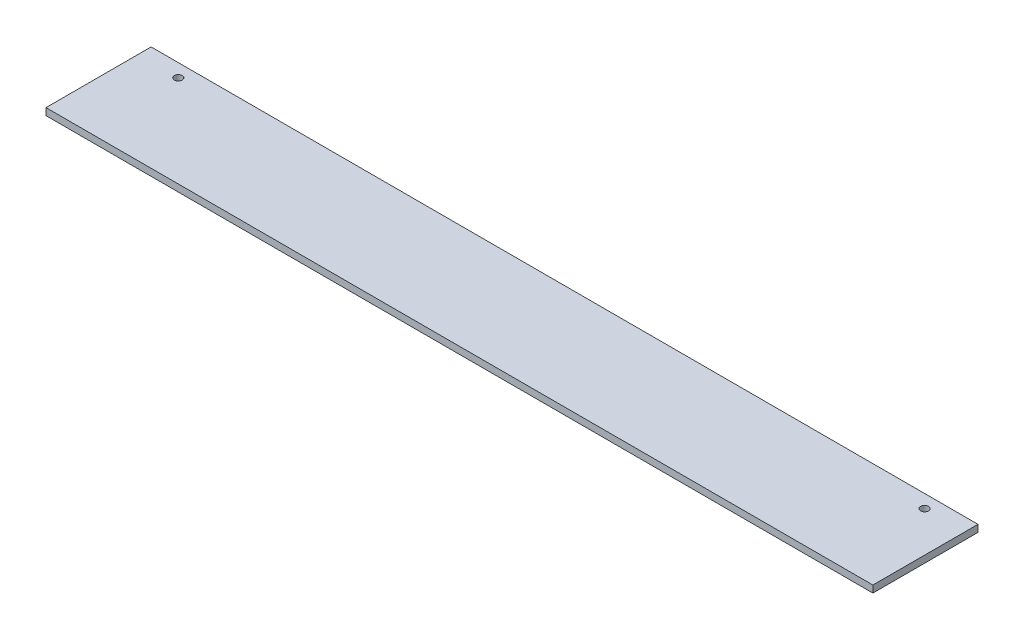
ISO-10303-21;
HEADER;
FILE_DESCRIPTION(('STEP AP214'),'2;1');
FILE_NAME('part.step','',(''),(''),'','','');
FILE_SCHEMA(('AUTOMOTIVE_DESIGN { 1 0 10303 214 1 1 1 1 }'));
ENDSEC;
DATA;
#1=APPLICATION_CONTEXT('core data for automotive mechanical design processes');
#2=APPLICATION_PROTOCOL_DEFINITION('international standard','automotive_design',2000,#1);
#3=PRODUCT_CONTEXT('',#1,'mechanical');
#4=PRODUCT('Part','Part','',(#3));
#5=PRODUCT_RELATED_PRODUCT_CATEGORY('part','',(#4));
#6=PRODUCT_DEFINITION_FORMATION('','',#4);
#7=PRODUCT_DEFINITION_CONTEXT('part definition',#1,'design');
#8=PRODUCT_DEFINITION('design','',#6,#7);
#9=PRODUCT_DEFINITION_SHAPE('','',#8);
#10=(LENGTH_UNIT() NAMED_UNIT(*) SI_UNIT(.MILLI.,.METRE.));
#11=(NAMED_UNIT(*) PLANE_ANGLE_UNIT() SI_UNIT($,.RADIAN.));
#12=(NAMED_UNIT(*) SI_UNIT($,.STERADIAN.) SOLID_ANGLE_UNIT());
#13=UNCERTAINTY_MEASURE_WITH_UNIT(LENGTH_MEASURE(1.E-05),#10,'distance_accuracy_value','');
#14=(GEOMETRIC_REPRESENTATION_CONTEXT(3) GLOBAL_UNCERTAINTY_ASSIGNED_CONTEXT((#13)) GLOBAL_UNIT_ASSIGNED_CONTEXT((#10,
#11,#12)) REPRESENTATION_CONTEXT('',''));
#15=CARTESIAN_POINT('',(0.,0.,0.));
#16=DIRECTION('',(0.,0.,1.));
#17=DIRECTION('',(1.,0.,0.));
#18=AXIS2_PLACEMENT_3D('',#15,#16,#17);
#19=CARTESIAN_POINT('',(472.,-2.,-30.));
#20=DIRECTION('',(0.,0.,1.));
#21=DIRECTION('',(1.,0.,0.));
#22=AXIS2_PLACEMENT_3D('',#19,#20,#21);
#23=PLANE('',#22);
#24=DIRECTION('',(0.,1.,0.));
#25=VECTOR('',#24,1.);
#26=CARTESIAN_POINT('',(0.,-2.,-30.));
#27=LINE('',#26,#25);
#28=CARTESIAN_POINT('',(0.,-2.,-30.));
#29=VERTEX_POINT('',#28);
#30=CARTESIAN_POINT('',(0.,2.,-30.));
#31=VERTEX_POINT('',#30);
#32=EDGE_CURVE('E98',#29,#31,#27,.T.);
#33=ORIENTED_EDGE('',*,*,#32,.T.);
#34=DIRECTION('',(-1.,0.,0.));
#35=VECTOR('',#34,1.);
#36=CARTESIAN_POINT('',(472.,2.,-30.));
#37=LINE('',#36,#35);
#38=CARTESIAN_POINT('',(472.,2.,-30.));
#39=VERTEX_POINT('',#38);
#40=EDGE_CURVE('E11',#39,#31,#37,.T.);
#41=ORIENTED_EDGE('',*,*,#40,.F.);
#42=DIRECTION('',(0.,1.,0.));
#43=VECTOR('',#42,1.);
#44=CARTESIAN_POINT('',(472.,-2.,-30.));
#45=LINE('',#44,#43);
#46=CARTESIAN_POINT('',(472.,-2.,-30.));
#47=VERTEX_POINT('',#46);
#48=EDGE_CURVE('E86',#47,#39,#45,.T.);
#49=ORIENTED_EDGE('',*,*,#48,.F.);
#50=DIRECTION('',(-1.,0.,0.));
#51=VECTOR('',#50,1.);
#52=CARTESIAN_POINT('',(472.,-2.,-30.));
#53=LINE('',#52,#51);
#54=EDGE_CURVE('E94',#47,#29,#53,.T.);
#55=ORIENTED_EDGE('',*,*,#54,.T.);
#56=EDGE_LOOP('',(#33,#41,#49,#55));
#57=FACE_BOUND('',#56,.T.);
#58=ADVANCED_FACE('F35',(#57),#23,.F.);
#59=CARTESIAN_POINT('',(472.,2.,30.));
#60=DIRECTION('',(0.,-1.,0.));
#61=DIRECTION('',(0.,0.,-1.));
#62=AXIS2_PLACEMENT_3D('',#59,#60,#61);
#63=PLANE('',#62);
#64=CARTESIAN_POINT('',(23.,2.,-22.5));
#65=DIRECTION('',(0.,1.,0.));
#66=DIRECTION('',(0.,0.,1.));
#67=AXIS2_PLACEMENT_3D('',#64,#65,#66);
#68=CIRCLE('',#67,2.25);
#69=CARTESIAN_POINT('',(23.,2.,-20.25));
#70=VERTEX_POINT('',#69);
#71=EDGE_CURVE('E118',#70,#70,#68,.T.);
#72=ORIENTED_EDGE('',*,*,#71,.F.);
#73=EDGE_LOOP('',(#72));
#74=FACE_BOUND('',#73,.T.);
#75=CARTESIAN_POINT('',(449.,2.,-22.5));
#76=DIRECTION('',(0.,1.,0.));
#77=DIRECTION('',(0.,0.,1.));
#78=AXIS2_PLACEMENT_3D('',#75,#76,#77);
#79=CIRCLE('',#78,2.24999999999995);
#80=CARTESIAN_POINT('',(449.,2.,-20.25));
#81=VERTEX_POINT('',#80);
#82=EDGE_CURVE('E112',#81,#81,#79,.T.);
#83=ORIENTED_EDGE('',*,*,#82,.F.);
#84=EDGE_LOOP('',(#83));
#85=FACE_BOUND('',#84,.T.);
#86=DIRECTION('',(0.,0.,1.));
#87=VECTOR('',#86,1.);
#88=CARTESIAN_POINT('',(0.,2.,30.));
#89=LINE('',#88,#87);
#90=CARTESIAN_POINT('',(0.,2.,30.));
#91=VERTEX_POINT('',#90);
#92=EDGE_CURVE('E90',#31,#91,#89,.T.);
#93=ORIENTED_EDGE('',*,*,#92,.T.);
#94=DIRECTION('',(-1.,0.,0.));
#95=VECTOR('',#94,1.);
#96=CARTESIAN_POINT('',(472.,2.,30.));
#97=LINE('',#96,#95);
#98=CARTESIAN_POINT('',(472.,2.,30.));
#99=VERTEX_POINT('',#98);
#100=EDGE_CURVE('E43',#99,#91,#97,.T.);
#101=ORIENTED_EDGE('',*,*,#100,.F.);
#102=DIRECTION('',(0.,0.,1.));
#103=VECTOR('',#102,1.);
#104=CARTESIAN_POINT('',(472.,2.,30.));
#105=LINE('',#104,#103);
#106=EDGE_CURVE('E81',#39,#99,#105,.T.);
#107=ORIENTED_EDGE('',*,*,#106,.F.);
#108=ORIENTED_EDGE('',*,*,#40,.T.);
#109=EDGE_LOOP('',(#93,#101,#107,#108));
#110=FACE_BOUND('',#109,.T.);
#111=ADVANCED_FACE('F89',(#74,#85,#110),#63,.F.);
#112=CARTESIAN_POINT('',(472.,-2.,30.));
#113=DIRECTION('',(0.,0.,-1.));
#114=DIRECTION('',(-1.,0.,0.));
#115=AXIS2_PLACEMENT_3D('',#112,#113,#114);
#116=PLANE('',#115);
#117=DIRECTION('',(0.,-1.,0.));
#118=VECTOR('',#117,1.);
#119=CARTESIAN_POINT('',(0.,-2.,30.));
#120=LINE('',#119,#118);
#121=CARTESIAN_POINT('',(0.,-2.,30.));
#122=VERTEX_POINT('',#121);
#123=EDGE_CURVE('E68',#91,#122,#120,.T.);
#124=ORIENTED_EDGE('',*,*,#123,.T.);
#125=DIRECTION('',(-1.,0.,0.));
#126=VECTOR('',#125,1.);
#127=CARTESIAN_POINT('',(472.,-2.,30.));
#128=LINE('',#127,#126);
#129=CARTESIAN_POINT('',(472.,-2.,30.));
#130=VERTEX_POINT('',#129);
#131=EDGE_CURVE('E91',#130,#122,#128,.T.);
#132=ORIENTED_EDGE('',*,*,#131,.F.);
#133=DIRECTION('',(0.,-1.,0.));
#134=VECTOR('',#133,1.);
#135=CARTESIAN_POINT('',(472.,-2.,30.));
#136=LINE('',#135,#134);
#137=EDGE_CURVE('E84',#99,#130,#136,.T.);
#138=ORIENTED_EDGE('',*,*,#137,.F.);
#139=ORIENTED_EDGE('',*,*,#100,.T.);
#140=EDGE_LOOP('',(#124,#132,#138,#139));
#141=FACE_BOUND('',#140,.T.);
#142=ADVANCED_FACE('F92',(#141),#116,.F.);
#143=CARTESIAN_POINT('',(472.,-2.,30.));
#144=DIRECTION('',(0.,1.,0.));
#145=DIRECTION('',(0.,0.,1.));
#146=AXIS2_PLACEMENT_3D('',#143,#144,#145);
#147=PLANE('',#146);
#148=CARTESIAN_POINT('',(23.,-2.,-22.5));
#149=DIRECTION('',(0.,1.,0.));
#150=DIRECTION('',(0.,0.,1.));
#151=AXIS2_PLACEMENT_3D('',#148,#149,#150);
#152=CIRCLE('',#151,2.25);
#153=CARTESIAN_POINT('',(23.,-2.,-20.25));
#154=VERTEX_POINT('',#153);
#155=EDGE_CURVE('E101',#154,#154,#152,.T.);
#156=ORIENTED_EDGE('',*,*,#155,.T.);
#157=EDGE_LOOP('',(#156));
#158=FACE_BOUND('',#157,.T.);
#159=CARTESIAN_POINT('',(449.,-2.,-22.5));
#160=DIRECTION('',(0.,1.,0.));
#161=DIRECTION('',(0.,0.,1.));
#162=AXIS2_PLACEMENT_3D('',#159,#160,#161);
#163=CIRCLE('',#162,2.24999999999995);
#164=CARTESIAN_POINT('',(449.,-2.,-20.25));
#165=VERTEX_POINT('',#164);
#166=EDGE_CURVE('E115',#165,#165,#163,.T.);
#167=ORIENTED_EDGE('',*,*,#166,.T.);
#168=EDGE_LOOP('',(#167));
#169=FACE_BOUND('',#168,.T.);
#170=DIRECTION('',(0.,0.,-1.));
#171=VECTOR('',#170,1.);
#172=CARTESIAN_POINT('',(0.,-2.,30.));
#173=LINE('',#172,#171);
#174=EDGE_CURVE('E74',#122,#29,#173,.T.);
#175=ORIENTED_EDGE('',*,*,#174,.T.);
#176=ORIENTED_EDGE('',*,*,#54,.F.);
#177=DIRECTION('',(0.,0.,-1.));
#178=VECTOR('',#177,1.);
#179=CARTESIAN_POINT('',(472.,-2.,30.));
#180=LINE('',#179,#178);
#181=EDGE_CURVE('E51',#130,#47,#180,.T.);
#182=ORIENTED_EDGE('',*,*,#181,.F.);
#183=ORIENTED_EDGE('',*,*,#131,.T.);
#184=EDGE_LOOP('',(#175,#176,#182,#183));
#185=FACE_BOUND('',#184,.T.);
#186=ADVANCED_FACE('F106',(#158,#169,#185),#147,.F.);
#187=CARTESIAN_POINT('',(472.,0.,0.));
#188=DIRECTION('',(-1.,0.,0.));
#189=DIRECTION('',(0.,0.,1.));
#190=AXIS2_PLACEMENT_3D('',#187,#188,#189);
#191=PLANE('',#190);
#192=ORIENTED_EDGE('',*,*,#48,.T.);
#193=ORIENTED_EDGE('',*,*,#106,.T.);
#194=ORIENTED_EDGE('',*,*,#137,.T.);
#195=ORIENTED_EDGE('',*,*,#181,.T.);
#196=EDGE_LOOP('',(#192,#193,#194,#195));
#197=FACE_BOUND('',#196,.T.);
#198=ADVANCED_FACE('F82',(#197),#191,.F.);
#199=CARTESIAN_POINT('',(0.,0.,0.));
#200=DIRECTION('',(-1.,0.,0.));
#201=DIRECTION('',(0.,0.,1.));
#202=AXIS2_PLACEMENT_3D('',#199,#200,#201);
#203=PLANE('',#202);
#204=ORIENTED_EDGE('',*,*,#32,.F.);
#205=ORIENTED_EDGE('',*,*,#174,.F.);
#206=ORIENTED_EDGE('',*,*,#123,.F.);
#207=ORIENTED_EDGE('',*,*,#92,.F.);
#208=EDGE_LOOP('',(#204,#205,#206,#207));
#209=FACE_BOUND('',#208,.T.);
#210=ADVANCED_FACE('F109',(#209),#203,.T.);
#211=CARTESIAN_POINT('',(449.,-2.,-22.5));
#212=DIRECTION('',(0.,1.,0.));
#213=DIRECTION('',(0.,0.,1.));
#214=AXIS2_PLACEMENT_3D('',#211,#212,#213);
#215=CYLINDRICAL_SURFACE('',#214,2.24999999999995);
#216=ORIENTED_EDGE('',*,*,#166,.F.);
#217=EDGE_LOOP('',(#216));
#218=FACE_BOUND('',#217,.T.);
#219=ORIENTED_EDGE('',*,*,#82,.T.);
#220=EDGE_LOOP('',(#219));
#221=FACE_BOUND('',#220,.T.);
#222=ADVANCED_FACE('F129',(#218,#221),#215,.F.);
#223=CARTESIAN_POINT('',(23.,-2.,-22.5));
#224=DIRECTION('',(0.,1.,0.));
#225=DIRECTION('',(0.,0.,1.));
#226=AXIS2_PLACEMENT_3D('',#223,#224,#225);
#227=CYLINDRICAL_SURFACE('',#226,2.25);
#228=ORIENTED_EDGE('',*,*,#155,.F.);
#229=EDGE_LOOP('',(#228));
#230=FACE_BOUND('',#229,.T.);
#231=ORIENTED_EDGE('',*,*,#71,.T.);
#232=EDGE_LOOP('',(#231));
#233=FACE_BOUND('',#232,.T.);
#234=ADVANCED_FACE('F126',(#230,#233),#227,.F.);
#235=CLOSED_SHELL('',(#58,#111,#142,#186,#198,#210,#222,#234));
#236=MANIFOLD_SOLID_BREP('B2',#235);
#237=ADVANCED_BREP_SHAPE_REPRESENTATION('',(#18,#236),#14);
#238=SHAPE_DEFINITION_REPRESENTATION(#9,#237);
ENDSEC;
END-ISO-10303-21;
